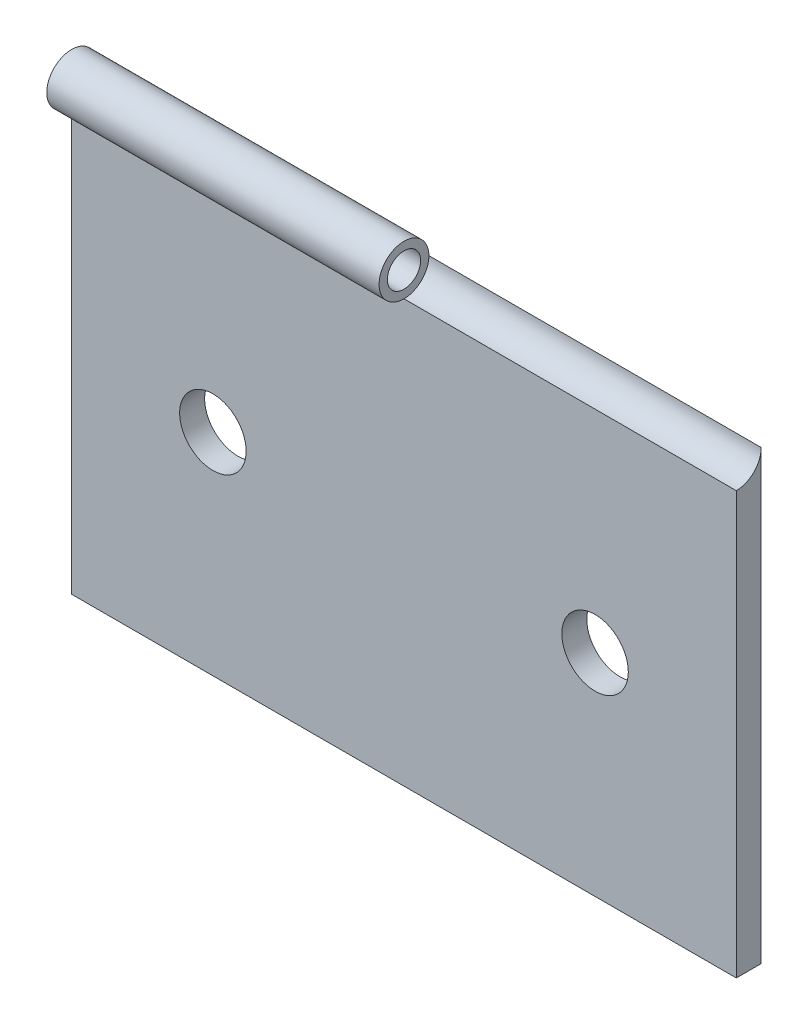
ISO-10303-21;
HEADER;
FILE_DESCRIPTION(('STEP AP214'),'2;1');
FILE_NAME('part.step','',(''),(''),'','','');
FILE_SCHEMA(('AUTOMOTIVE_DESIGN { 1 0 10303 214 1 1 1 1 }'));
ENDSEC;
DATA;
#1=APPLICATION_CONTEXT('core data for automotive mechanical design processes');
#2=APPLICATION_PROTOCOL_DEFINITION('international standard','automotive_design',2000,#1);
#3=PRODUCT_CONTEXT('',#1,'mechanical');
#4=PRODUCT('Part','Part','',(#3));
#5=PRODUCT_RELATED_PRODUCT_CATEGORY('part','',(#4));
#6=PRODUCT_DEFINITION_FORMATION('','',#4);
#7=PRODUCT_DEFINITION_CONTEXT('part definition',#1,'design');
#8=PRODUCT_DEFINITION('design','',#6,#7);
#9=PRODUCT_DEFINITION_SHAPE('','',#8);
#10=(LENGTH_UNIT() NAMED_UNIT(*) SI_UNIT(.MILLI.,.METRE.));
#11=(NAMED_UNIT(*) PLANE_ANGLE_UNIT() SI_UNIT($,.RADIAN.));
#12=(NAMED_UNIT(*) SI_UNIT($,.STERADIAN.) SOLID_ANGLE_UNIT());
#13=UNCERTAINTY_MEASURE_WITH_UNIT(LENGTH_MEASURE(1.E-05),#10,'distance_accuracy_value','');
#14=(GEOMETRIC_REPRESENTATION_CONTEXT(3) GLOBAL_UNCERTAINTY_ASSIGNED_CONTEXT((#13)) GLOBAL_UNIT_ASSIGNED_CONTEXT((#10,
#11,#12)) REPRESENTATION_CONTEXT('',''));
#15=CARTESIAN_POINT('',(0.,0.,0.));
#16=DIRECTION('',(0.,0.,1.));
#17=DIRECTION('',(1.,0.,0.));
#18=AXIS2_PLACEMENT_3D('',#15,#16,#17);
#19=CARTESIAN_POINT('',(-20.,14.2,0.749999999999973));
#20=DIRECTION('',(1.,0.,0.));
#21=DIRECTION('',(0.,0.,-1.));
#22=AXIS2_PLACEMENT_3D('',#19,#20,#21);
#23=CYLINDRICAL_SURFACE('',#22,1.5);
#24=DIRECTION('',(1.,0.,0.));
#25=VECTOR('',#24,1.);
#26=CARTESIAN_POINT('',(-20.,12.7,0.749999999999973));
#27=LINE('',#26,#25);
#28=CARTESIAN_POINT('',(-20.,12.7,0.749999999999973));
#29=VERTEX_POINT('',#28);
#30=CARTESIAN_POINT('',(0.,12.7,0.749999999999973));
#31=VERTEX_POINT('',#30);
#32=EDGE_CURVE('E107',#29,#31,#27,.T.);
#33=ORIENTED_EDGE('',*,*,#32,.T.);
#34=CARTESIAN_POINT('',(0.,14.2,0.749999999999973));
#35=DIRECTION('',(1.,0.,0.));
#36=DIRECTION('',(0.,0.,-1.));
#37=AXIS2_PLACEMENT_3D('',#34,#35,#36);
#38=CIRCLE('',#37,1.5);
#39=CARTESIAN_POINT('',(0.,14.2,-0.749999999999973));
#40=VERTEX_POINT('',#39);
#41=EDGE_CURVE('E99',#40,#31,#38,.T.);
#42=ORIENTED_EDGE('',*,*,#41,.F.);
#43=DIRECTION('',(1.,0.,0.));
#44=VECTOR('',#43,1.);
#45=CARTESIAN_POINT('',(-20.,14.2,-0.749999999999973));
#46=LINE('',#45,#44);
#47=CARTESIAN_POINT('',(-20.,14.2,-0.749999999999973));
#48=VERTEX_POINT('',#47);
#49=EDGE_CURVE('E106',#48,#40,#46,.T.);
#50=ORIENTED_EDGE('',*,*,#49,.F.);
#51=CARTESIAN_POINT('',(-20.,14.2,0.749999999999973));
#52=DIRECTION('',(1.,0.,0.));
#53=DIRECTION('',(0.,0.,-1.));
#54=AXIS2_PLACEMENT_3D('',#51,#52,#53);
#55=CIRCLE('',#54,1.5);
#56=EDGE_CURVE('E119',#48,#29,#55,.T.);
#57=ORIENTED_EDGE('',*,*,#56,.T.);
#58=EDGE_LOOP('',(#33,#42,#50,#57));
#59=FACE_BOUND('',#58,.T.);
#60=ADVANCED_FACE('F36',(#59),#23,.T.);
#61=CARTESIAN_POINT('',(-20.,14.2,0.749999999999973));
#62=DIRECTION('',(1.,0.,0.));
#63=DIRECTION('',(0.,0.,-1.));
#64=AXIS2_PLACEMENT_3D('',#61,#62,#63);
#65=CYLINDRICAL_SURFACE('',#64,1.);
#66=CARTESIAN_POINT('',(-20.,14.2,0.749999999999973));
#67=DIRECTION('',(1.,0.,0.));
#68=DIRECTION('',(0.,0.,-1.));
#69=AXIS2_PLACEMENT_3D('',#66,#67,#68);
#70=CIRCLE('',#69,1.);
#71=CARTESIAN_POINT('',(-20.,14.2,-0.250000000000028));
#72=VERTEX_POINT('',#71);
#73=EDGE_CURVE('E122',#72,#72,#70,.T.);
#74=ORIENTED_EDGE('',*,*,#73,.F.);
#75=EDGE_LOOP('',(#74));
#76=FACE_BOUND('',#75,.T.);
#77=CARTESIAN_POINT('',(0.,14.2,0.749999999999973));
#78=DIRECTION('',(1.,0.,0.));
#79=DIRECTION('',(0.,0.,-1.));
#80=AXIS2_PLACEMENT_3D('',#77,#78,#79);
#81=CIRCLE('',#80,1.);
#82=CARTESIAN_POINT('',(0.,14.2,-0.250000000000028));
#83=VERTEX_POINT('',#82);
#84=EDGE_CURVE('E39',#83,#83,#81,.F.);
#85=ORIENTED_EDGE('',*,*,#84,.F.);
#86=EDGE_LOOP('',(#85));
#87=FACE_BOUND('',#86,.T.);
#88=ADVANCED_FACE('F170',(#76,#87),#65,.F.);
#89=CARTESIAN_POINT('',(-20.,-12.7,-0.749999999999973));
#90=DIRECTION('',(0.,0.,-1.));
#91=DIRECTION('',(-1.,0.,0.));
#92=AXIS2_PLACEMENT_3D('',#89,#90,#91);
#93=PLANE('',#92);
#94=CARTESIAN_POINT('',(-11.5,0.,-0.749999999999973));
#95=DIRECTION('',(0.,0.,-1.));
#96=DIRECTION('',(-1.,0.,0.));
#97=AXIS2_PLACEMENT_3D('',#94,#95,#96);
#98=CIRCLE('',#97,2.);
#99=CARTESIAN_POINT('',(-13.5,0.,-0.749999999999973));
#100=VERTEX_POINT('',#99);
#101=EDGE_CURVE('E101',#100,#100,#98,.F.);
#102=ORIENTED_EDGE('',*,*,#101,.T.);
#103=EDGE_LOOP('',(#102));
#104=FACE_BOUND('',#103,.T.);
#105=CARTESIAN_POINT('',(11.5,0.,-0.749999999999973));
#106=DIRECTION('',(0.,0.,-1.));
#107=DIRECTION('',(-1.,0.,0.));
#108=AXIS2_PLACEMENT_3D('',#105,#106,#107);
#109=CIRCLE('',#108,2.);
#110=CARTESIAN_POINT('',(9.50000000000001,0.,-0.749999999999973));
#111=VERTEX_POINT('',#110);
#112=EDGE_CURVE('E134',#111,#111,#109,.F.);
#113=ORIENTED_EDGE('',*,*,#112,.T.);
#114=EDGE_LOOP('',(#113));
#115=FACE_BOUND('',#114,.T.);
#116=ORIENTED_EDGE('',*,*,#49,.T.);
#117=DIRECTION('',(1.,0.,0.));
#118=VECTOR('',#117,1.);
#119=CARTESIAN_POINT('',(0.,14.2,-0.749999999999973));
#120=LINE('',#119,#118);
#121=CARTESIAN_POINT('',(20.,14.2,-0.749999999999973));
#122=VERTEX_POINT('',#121);
#123=EDGE_CURVE('E83',#40,#122,#120,.T.);
#124=ORIENTED_EDGE('',*,*,#123,.T.);
#125=DIRECTION('',(0.,1.,0.));
#126=VECTOR('',#125,1.);
#127=CARTESIAN_POINT('',(20.,12.7,-0.749999999999973));
#128=LINE('',#127,#126);
#129=CARTESIAN_POINT('',(20.,-12.7,-0.749999999999973));
#130=VERTEX_POINT('',#129);
#131=EDGE_CURVE('E131',#130,#122,#128,.T.);
#132=ORIENTED_EDGE('',*,*,#131,.F.);
#133=DIRECTION('',(1.,0.,0.));
#134=VECTOR('',#133,1.);
#135=CARTESIAN_POINT('',(-20.,-12.7,-0.749999999999973));
#136=LINE('',#135,#134);
#137=CARTESIAN_POINT('',(-20.,-12.7,-0.749999999999973));
#138=VERTEX_POINT('',#137);
#139=EDGE_CURVE('E44',#138,#130,#136,.T.);
#140=ORIENTED_EDGE('',*,*,#139,.F.);
#141=DIRECTION('',(0.,1.,0.));
#142=VECTOR('',#141,1.);
#143=CARTESIAN_POINT('',(-20.,12.7,-0.749999999999973));
#144=LINE('',#143,#142);
#145=EDGE_CURVE('E51',#138,#48,#144,.T.);
#146=ORIENTED_EDGE('',*,*,#145,.T.);
#147=EDGE_LOOP('',(#116,#124,#132,#140,#146));
#148=FACE_BOUND('',#147,.T.);
#149=ADVANCED_FACE('F108',(#104,#115,#148),#93,.T.);
#150=CARTESIAN_POINT('',(-20.,-12.7,0.749999999999973));
#151=DIRECTION('',(0.,-1.,0.));
#152=DIRECTION('',(0.,0.,-1.));
#153=AXIS2_PLACEMENT_3D('',#150,#151,#152);
#154=PLANE('',#153);
#155=ORIENTED_EDGE('',*,*,#139,.T.);
#156=DIRECTION('',(0.,0.,-1.));
#157=VECTOR('',#156,1.);
#158=CARTESIAN_POINT('',(20.,-12.7,0.749999999999973));
#159=LINE('',#158,#157);
#160=CARTESIAN_POINT('',(20.,-12.7,0.749999999999973));
#161=VERTEX_POINT('',#160);
#162=EDGE_CURVE('E125',#161,#130,#159,.T.);
#163=ORIENTED_EDGE('',*,*,#162,.F.);
#164=DIRECTION('',(1.,0.,0.));
#165=VECTOR('',#164,1.);
#166=CARTESIAN_POINT('',(-20.,-12.7,0.749999999999973));
#167=LINE('',#166,#165);
#168=CARTESIAN_POINT('',(-20.,-12.7,0.749999999999973));
#169=VERTEX_POINT('',#168);
#170=EDGE_CURVE('E59',#169,#161,#167,.T.);
#171=ORIENTED_EDGE('',*,*,#170,.F.);
#172=DIRECTION('',(0.,0.,-1.));
#173=VECTOR('',#172,1.);
#174=CARTESIAN_POINT('',(-20.,-12.7,0.749999999999973));
#175=LINE('',#174,#173);
#176=EDGE_CURVE('E109',#169,#138,#175,.T.);
#177=ORIENTED_EDGE('',*,*,#176,.T.);
#178=EDGE_LOOP('',(#155,#163,#171,#177));
#179=FACE_BOUND('',#178,.T.);
#180=ADVANCED_FACE('F153',(#179),#154,.T.);
#181=CARTESIAN_POINT('',(-20.,-12.7,0.749999999999973));
#182=DIRECTION('',(0.,0.,1.));
#183=DIRECTION('',(1.,0.,0.));
#184=AXIS2_PLACEMENT_3D('',#181,#182,#183);
#185=PLANE('',#184);
#186=CARTESIAN_POINT('',(-11.5,0.,0.749999999999973));
#187=DIRECTION('',(0.,0.,1.));
#188=DIRECTION('',(1.,0.,0.));
#189=AXIS2_PLACEMENT_3D('',#186,#187,#188);
#190=CIRCLE('',#189,2.);
#191=CARTESIAN_POINT('',(-9.49999999999998,0.,0.749999999999973));
#192=VERTEX_POINT('',#191);
#193=EDGE_CURVE('E137',#192,#192,#190,.T.);
#194=ORIENTED_EDGE('',*,*,#193,.F.);
#195=EDGE_LOOP('',(#194));
#196=FACE_BOUND('',#195,.T.);
#197=CARTESIAN_POINT('',(11.5,0.,0.749999999999973));
#198=DIRECTION('',(0.,0.,1.));
#199=DIRECTION('',(1.,0.,0.));
#200=AXIS2_PLACEMENT_3D('',#197,#198,#199);
#201=CIRCLE('',#200,2.);
#202=CARTESIAN_POINT('',(13.5,0.,0.749999999999973));
#203=VERTEX_POINT('',#202);
#204=EDGE_CURVE('E138',#203,#203,#201,.T.);
#205=ORIENTED_EDGE('',*,*,#204,.F.);
#206=EDGE_LOOP('',(#205));
#207=FACE_BOUND('',#206,.T.);
#208=ORIENTED_EDGE('',*,*,#170,.T.);
#209=DIRECTION('',(0.,-1.,0.));
#210=VECTOR('',#209,1.);
#211=CARTESIAN_POINT('',(20.,-12.7,0.749999999999973));
#212=LINE('',#211,#210);
#213=CARTESIAN_POINT('',(20.,12.7,0.749999999999973));
#214=VERTEX_POINT('',#213);
#215=EDGE_CURVE('E128',#214,#161,#212,.T.);
#216=ORIENTED_EDGE('',*,*,#215,.F.);
#217=DIRECTION('',(1.,0.,0.));
#218=VECTOR('',#217,1.);
#219=CARTESIAN_POINT('',(0.,12.7,0.749999999999973));
#220=LINE('',#219,#218);
#221=EDGE_CURVE('E93',#31,#214,#220,.T.);
#222=ORIENTED_EDGE('',*,*,#221,.F.);
#223=ORIENTED_EDGE('',*,*,#32,.F.);
#224=DIRECTION('',(0.,-1.,0.));
#225=VECTOR('',#224,1.);
#226=CARTESIAN_POINT('',(-20.,-12.7,0.749999999999973));
#227=LINE('',#226,#225);
#228=EDGE_CURVE('E112',#29,#169,#227,.T.);
#229=ORIENTED_EDGE('',*,*,#228,.T.);
#230=EDGE_LOOP('',(#208,#216,#222,#223,#229));
#231=FACE_BOUND('',#230,.T.);
#232=ADVANCED_FACE('F149',(#196,#207,#231),#185,.T.);
#233=CARTESIAN_POINT('',(-20.,14.2,0.749999999999973));
#234=DIRECTION('',(1.,0.,0.));
#235=DIRECTION('',(0.,0.,-1.));
#236=AXIS2_PLACEMENT_3D('',#233,#234,#235);
#237=PLANE('',#236);
#238=ORIENTED_EDGE('',*,*,#73,.T.);
#239=EDGE_LOOP('',(#238));
#240=FACE_BOUND('',#239,.T.);
#241=ORIENTED_EDGE('',*,*,#145,.F.);
#242=ORIENTED_EDGE('',*,*,#176,.F.);
#243=ORIENTED_EDGE('',*,*,#228,.F.);
#244=ORIENTED_EDGE('',*,*,#56,.F.);
#245=EDGE_LOOP('',(#241,#242,#243,#244));
#246=FACE_BOUND('',#245,.T.);
#247=ADVANCED_FACE('F152',(#240,#246),#237,.F.);
#248=CARTESIAN_POINT('',(20.,14.2,0.749999999999973));
#249=DIRECTION('',(1.,0.,0.));
#250=DIRECTION('',(0.,0.,-1.));
#251=AXIS2_PLACEMENT_3D('',#248,#249,#250);
#252=PLANE('',#251);
#253=CARTESIAN_POINT('',(20.,14.2,0.749999999999973));
#254=DIRECTION('',(1.,0.,0.));
#255=DIRECTION('',(0.,0.,-1.));
#256=AXIS2_PLACEMENT_3D('',#253,#254,#255);
#257=CIRCLE('',#256,1.5);
#258=EDGE_CURVE('E11',#214,#122,#257,.T.);
#259=ORIENTED_EDGE('',*,*,#258,.F.);
#260=ORIENTED_EDGE('',*,*,#215,.T.);
#261=ORIENTED_EDGE('',*,*,#162,.T.);
#262=ORIENTED_EDGE('',*,*,#131,.T.);
#263=EDGE_LOOP('',(#259,#260,#261,#262));
#264=FACE_BOUND('',#263,.T.);
#265=ADVANCED_FACE('F159',(#264),#252,.T.);
#266=CARTESIAN_POINT('',(0.,14.2,0.749999999999973));
#267=DIRECTION('',(1.,0.,0.));
#268=DIRECTION('',(0.,0.,-1.));
#269=AXIS2_PLACEMENT_3D('',#266,#267,#268);
#270=PLANE('',#269);
#271=ORIENTED_EDGE('',*,*,#41,.T.);
#272=EDGE_CURVE('E86',#31,#40,#38,.T.);
#273=ORIENTED_EDGE('',*,*,#272,.T.);
#274=EDGE_LOOP('',(#271,#273));
#275=FACE_BOUND('',#274,.T.);
#276=ORIENTED_EDGE('',*,*,#84,.T.);
#277=EDGE_LOOP('',(#276));
#278=FACE_BOUND('',#277,.T.);
#279=ADVANCED_FACE('F97',(#275,#278),#270,.T.);
#280=CARTESIAN_POINT('',(0.,14.2,0.749999999999973));
#281=DIRECTION('',(1.,0.,0.));
#282=DIRECTION('',(0.,0.,-1.));
#283=AXIS2_PLACEMENT_3D('',#280,#281,#282);
#284=CYLINDRICAL_SURFACE('',#283,1.5);
#285=ORIENTED_EDGE('',*,*,#272,.F.);
#286=ORIENTED_EDGE('',*,*,#221,.T.);
#287=ORIENTED_EDGE('',*,*,#258,.T.);
#288=ORIENTED_EDGE('',*,*,#123,.F.);
#289=EDGE_LOOP('',(#285,#286,#287,#288));
#290=FACE_BOUND('',#289,.T.);
#291=ADVANCED_FACE('F85',(#290),#284,.F.);
#292=CARTESIAN_POINT('',(11.5,0.,-6.40685424949239));
#293=DIRECTION('',(0.,0.,1.));
#294=DIRECTION('',(1.,0.,0.));
#295=AXIS2_PLACEMENT_3D('',#292,#293,#294);
#296=CYLINDRICAL_SURFACE('',#295,2.);
#297=ORIENTED_EDGE('',*,*,#204,.T.);
#298=EDGE_LOOP('',(#297));
#299=FACE_BOUND('',#298,.T.);
#300=ORIENTED_EDGE('',*,*,#112,.F.);
#301=EDGE_LOOP('',(#300));
#302=FACE_BOUND('',#301,.T.);
#303=ADVANCED_FACE('F184',(#299,#302),#296,.F.);
#304=CARTESIAN_POINT('',(-11.5,0.,-6.40685424949239));
#305=DIRECTION('',(0.,0.,1.));
#306=DIRECTION('',(1.,0.,0.));
#307=AXIS2_PLACEMENT_3D('',#304,#305,#306);
#308=CYLINDRICAL_SURFACE('',#307,2.);
#309=ORIENTED_EDGE('',*,*,#193,.T.);
#310=EDGE_LOOP('',(#309));
#311=FACE_BOUND('',#310,.T.);
#312=ORIENTED_EDGE('',*,*,#101,.F.);
#313=EDGE_LOOP('',(#312));
#314=FACE_BOUND('',#313,.T.);
#315=ADVANCED_FACE('F146',(#311,#314),#308,.F.);
#316=CLOSED_SHELL('',(#60,#88,#149,#180,#232,#247,#265,#279,#291,#303,#315));
#317=MANIFOLD_SOLID_BREP('B2',#316);
#318=ADVANCED_BREP_SHAPE_REPRESENTATION('',(#18,#317),#14);
#319=SHAPE_DEFINITION_REPRESENTATION(#9,#318);
ENDSEC;
END-ISO-10303-21;
